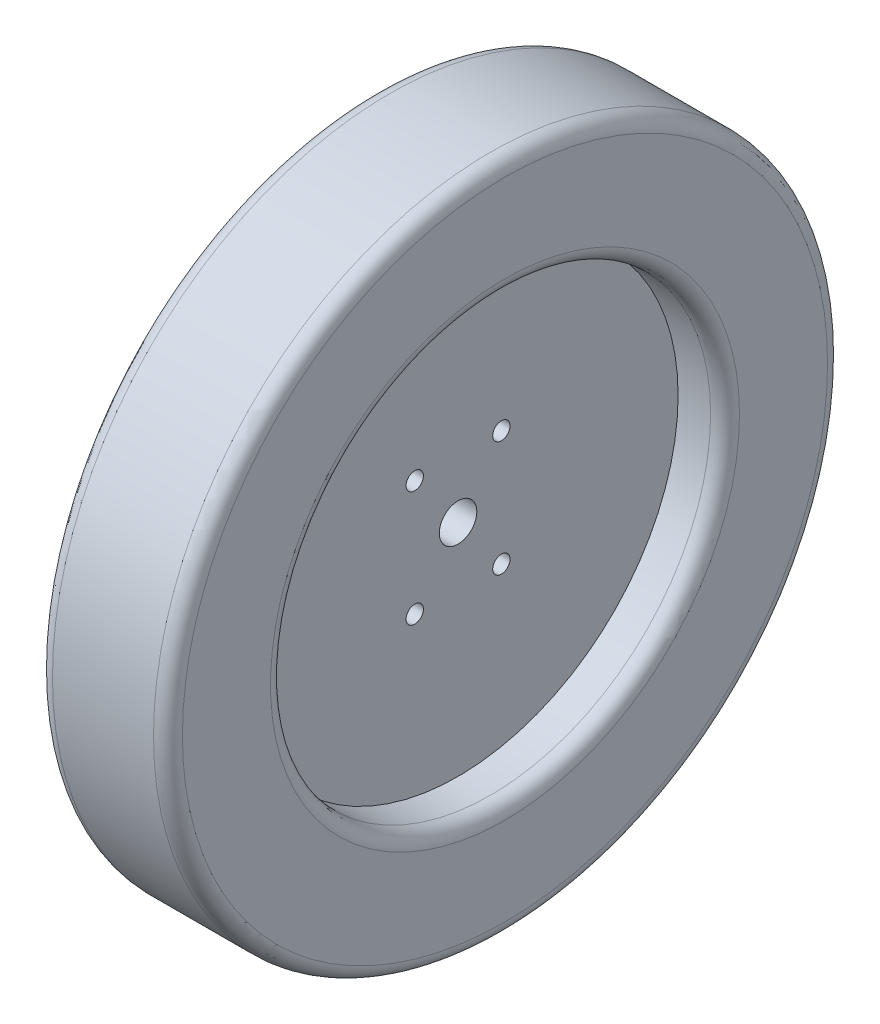
ISO-10303-21;
HEADER;
FILE_DESCRIPTION(('STEP AP214'),'2;1');
FILE_NAME('part.step','',(''),(''),'','','');
FILE_SCHEMA(('AUTOMOTIVE_DESIGN { 1 0 10303 214 1 1 1 1 }'));
ENDSEC;
DATA;
#1=APPLICATION_CONTEXT('core data for automotive mechanical design processes');
#2=APPLICATION_PROTOCOL_DEFINITION('international standard','automotive_design',2000,#1);
#3=PRODUCT_CONTEXT('',#1,'mechanical');
#4=PRODUCT('Part','Part','',(#3));
#5=PRODUCT_RELATED_PRODUCT_CATEGORY('part','',(#4));
#6=PRODUCT_DEFINITION_FORMATION('','',#4);
#7=PRODUCT_DEFINITION_CONTEXT('part definition',#1,'design');
#8=PRODUCT_DEFINITION('design','',#6,#7);
#9=PRODUCT_DEFINITION_SHAPE('','',#8);
#10=(LENGTH_UNIT() NAMED_UNIT(*) SI_UNIT(.MILLI.,.METRE.));
#11=(NAMED_UNIT(*) PLANE_ANGLE_UNIT() SI_UNIT($,.RADIAN.));
#12=(NAMED_UNIT(*) SI_UNIT($,.STERADIAN.) SOLID_ANGLE_UNIT());
#13=UNCERTAINTY_MEASURE_WITH_UNIT(LENGTH_MEASURE(1.E-05),#10,'distance_accuracy_value','');
#14=(GEOMETRIC_REPRESENTATION_CONTEXT(3) GLOBAL_UNCERTAINTY_ASSIGNED_CONTEXT((#13)) GLOBAL_UNIT_ASSIGNED_CONTEXT((#10,
#11,#12)) REPRESENTATION_CONTEXT('',''));
#15=CARTESIAN_POINT('',(0.,0.,0.));
#16=DIRECTION('',(0.,0.,1.));
#17=DIRECTION('',(1.,0.,0.));
#18=AXIS2_PLACEMENT_3D('',#15,#16,#17);
#19=CARTESIAN_POINT('',(-12.5,0.,0.));
#20=DIRECTION('',(1.,0.,0.));
#21=DIRECTION('',(0.,0.,-1.));
#22=AXIS2_PLACEMENT_3D('',#19,#20,#21);
#23=PLANE('',#22);
#24=CARTESIAN_POINT('',(-12.5,-40.,-30.));
#25=DIRECTION('',(1.,0.,0.));
#26=DIRECTION('',(0.,0.,-1.));
#27=AXIS2_PLACEMENT_3D('',#24,#25,#26);
#28=CIRCLE('',#27,5.99999999999999);
#29=CARTESIAN_POINT('',(-12.5,-40.,-36.));
#30=VERTEX_POINT('',#29);
#31=EDGE_CURVE('E91',#30,#30,#28,.F.);
#32=ORIENTED_EDGE('',*,*,#31,.F.);
#33=EDGE_LOOP('',(#32));
#34=FACE_BOUND('',#33,.T.);
#35=CARTESIAN_POINT('',(-12.5,0.,0.));
#36=DIRECTION('',(1.,0.,0.));
#37=DIRECTION('',(0.,0.,-1.));
#38=AXIS2_PLACEMENT_3D('',#35,#36,#37);
#39=CIRCLE('',#38,13.);
#40=CARTESIAN_POINT('',(-12.5,0.,-13.));
#41=VERTEX_POINT('',#40);
#42=EDGE_CURVE('E73',#41,#41,#39,.T.);
#43=ORIENTED_EDGE('',*,*,#42,.T.);
#44=EDGE_LOOP('',(#43));
#45=FACE_BOUND('',#44,.T.);
#46=CARTESIAN_POINT('',(-12.5,0.,0.));
#47=DIRECTION('',(1.,0.,0.));
#48=DIRECTION('',(0.,0.,-1.));
#49=AXIS2_PLACEMENT_3D('',#46,#47,#48);
#50=CIRCLE('',#49,152.4);
#51=CARTESIAN_POINT('',(-12.5,0.,-152.4));
#52=VERTEX_POINT('',#51);
#53=EDGE_CURVE('E95',#52,#52,#50,.T.);
#54=ORIENTED_EDGE('',*,*,#53,.F.);
#55=EDGE_LOOP('',(#54));
#56=FACE_BOUND('',#55,.T.);
#57=CARTESIAN_POINT('',(-12.5,40.,30.));
#58=DIRECTION('',(1.,0.,0.));
#59=DIRECTION('',(0.,0.,-1.));
#60=AXIS2_PLACEMENT_3D('',#57,#58,#59);
#61=CIRCLE('',#60,6.);
#62=CARTESIAN_POINT('',(-12.5,40.,24.));
#63=VERTEX_POINT('',#62);
#64=EDGE_CURVE('E64',#63,#63,#61,.F.);
#65=ORIENTED_EDGE('',*,*,#64,.F.);
#66=EDGE_LOOP('',(#65));
#67=FACE_BOUND('',#66,.T.);
#68=CARTESIAN_POINT('',(-12.5,40.,-30.));
#69=DIRECTION('',(1.,0.,0.));
#70=DIRECTION('',(0.,0.,-1.));
#71=AXIS2_PLACEMENT_3D('',#68,#69,#70);
#72=CIRCLE('',#71,6.);
#73=CARTESIAN_POINT('',(-12.5,40.,-36.));
#74=VERTEX_POINT('',#73);
#75=EDGE_CURVE('E69',#74,#74,#72,.T.);
#76=ORIENTED_EDGE('',*,*,#75,.T.);
#77=EDGE_LOOP('',(#76));
#78=FACE_BOUND('',#77,.T.);
#79=CARTESIAN_POINT('',(-12.5,-40.,30.));
#80=DIRECTION('',(1.,0.,0.));
#81=DIRECTION('',(0.,0.,-1.));
#82=AXIS2_PLACEMENT_3D('',#79,#80,#81);
#83=CIRCLE('',#82,5.99999999999999);
#84=CARTESIAN_POINT('',(-12.5,-40.,24.));
#85=VERTEX_POINT('',#84);
#86=EDGE_CURVE('E77',#85,#85,#83,.T.);
#87=ORIENTED_EDGE('',*,*,#86,.T.);
#88=EDGE_LOOP('',(#87));
#89=FACE_BOUND('',#88,.T.);
#90=ADVANCED_FACE('F41',(#34,#45,#56,#67,#78,#89),#23,.F.);
#91=CARTESIAN_POINT('',(12.5,0.,0.));
#92=DIRECTION('',(1.,0.,0.));
#93=DIRECTION('',(0.,0.,-1.));
#94=AXIS2_PLACEMENT_3D('',#91,#92,#93);
#95=PLANE('',#94);
#96=CARTESIAN_POINT('',(12.5,-40.,-30.));
#97=DIRECTION('',(1.,0.,0.));
#98=DIRECTION('',(0.,0.,-1.));
#99=AXIS2_PLACEMENT_3D('',#96,#97,#98);
#100=CIRCLE('',#99,5.99999999999999);
#101=CARTESIAN_POINT('',(12.5,-40.,-36.));
#102=VERTEX_POINT('',#101);
#103=EDGE_CURVE('E45',#102,#102,#100,.F.);
#104=ORIENTED_EDGE('',*,*,#103,.T.);
#105=EDGE_LOOP('',(#104));
#106=FACE_BOUND('',#105,.T.);
#107=CARTESIAN_POINT('',(12.5,40.,30.));
#108=DIRECTION('',(1.,0.,0.));
#109=DIRECTION('',(0.,0.,-1.));
#110=AXIS2_PLACEMENT_3D('',#107,#108,#109);
#111=CIRCLE('',#110,6.);
#112=CARTESIAN_POINT('',(12.5,40.,24.));
#113=VERTEX_POINT('',#112);
#114=EDGE_CURVE('E60',#113,#113,#111,.F.);
#115=ORIENTED_EDGE('',*,*,#114,.T.);
#116=EDGE_LOOP('',(#115));
#117=FACE_BOUND('',#116,.T.);
#118=CARTESIAN_POINT('',(12.5,0.,0.));
#119=DIRECTION('',(1.,0.,0.));
#120=DIRECTION('',(0.,0.,-1.));
#121=AXIS2_PLACEMENT_3D('',#118,#119,#120);
#122=CIRCLE('',#121,152.4);
#123=CARTESIAN_POINT('',(12.5,0.,-152.4));
#124=VERTEX_POINT('',#123);
#125=EDGE_CURVE('E99',#124,#124,#122,.T.);
#126=ORIENTED_EDGE('',*,*,#125,.T.);
#127=EDGE_LOOP('',(#126));
#128=FACE_BOUND('',#127,.T.);
#129=CARTESIAN_POINT('',(12.5,40.,-30.));
#130=DIRECTION('',(1.,0.,0.));
#131=DIRECTION('',(0.,0.,-1.));
#132=AXIS2_PLACEMENT_3D('',#129,#130,#131);
#133=CIRCLE('',#132,6.);
#134=CARTESIAN_POINT('',(12.5,40.,-36.));
#135=VERTEX_POINT('',#134);
#136=EDGE_CURVE('E65',#135,#135,#133,.T.);
#137=ORIENTED_EDGE('',*,*,#136,.F.);
#138=EDGE_LOOP('',(#137));
#139=FACE_BOUND('',#138,.T.);
#140=CARTESIAN_POINT('',(12.5,0.,0.));
#141=DIRECTION('',(1.,0.,0.));
#142=DIRECTION('',(0.,0.,-1.));
#143=AXIS2_PLACEMENT_3D('',#140,#141,#142);
#144=CIRCLE('',#143,13.);
#145=CARTESIAN_POINT('',(12.5,0.,-13.));
#146=VERTEX_POINT('',#145);
#147=EDGE_CURVE('E70',#146,#146,#144,.T.);
#148=ORIENTED_EDGE('',*,*,#147,.F.);
#149=EDGE_LOOP('',(#148));
#150=FACE_BOUND('',#149,.T.);
#151=CARTESIAN_POINT('',(12.5,-40.,30.));
#152=DIRECTION('',(1.,0.,0.));
#153=DIRECTION('',(0.,0.,-1.));
#154=AXIS2_PLACEMENT_3D('',#151,#152,#153);
#155=CIRCLE('',#154,5.99999999999999);
#156=CARTESIAN_POINT('',(12.5,-40.,24.));
#157=VERTEX_POINT('',#156);
#158=EDGE_CURVE('E74',#157,#157,#155,.T.);
#159=ORIENTED_EDGE('',*,*,#158,.F.);
#160=EDGE_LOOP('',(#159));
#161=FACE_BOUND('',#160,.T.);
#162=ADVANCED_FACE('F144',(#106,#117,#128,#139,#150,#161),#95,.T.);
#163=CARTESIAN_POINT('',(45.,0.,0.));
#164=DIRECTION('',(-1.,0.,0.));
#165=DIRECTION('',(0.,0.,1.));
#166=AXIS2_PLACEMENT_3D('',#163,#164,#165);
#167=CYLINDRICAL_SURFACE('',#166,152.4);
#168=CARTESIAN_POINT('',(-35.,0.,0.));
#169=DIRECTION('',(1.,0.,0.));
#170=DIRECTION('',(0.,0.,-1.));
#171=AXIS2_PLACEMENT_3D('',#168,#169,#170);
#172=CIRCLE('',#171,152.4);
#173=CARTESIAN_POINT('',(-35.,0.,-152.4));
#174=VERTEX_POINT('',#173);
#175=EDGE_CURVE('E11',#174,#174,#172,.F.);
#176=ORIENTED_EDGE('',*,*,#175,.T.);
#177=EDGE_LOOP('',(#176));
#178=FACE_BOUND('',#177,.T.);
#179=ORIENTED_EDGE('',*,*,#53,.T.);
#180=EDGE_LOOP('',(#179));
#181=FACE_BOUND('',#180,.T.);
#182=ADVANCED_FACE('F141',(#178,#181),#167,.F.);
#183=CARTESIAN_POINT('',(45.,0.,0.));
#184=DIRECTION('',(1.,0.,0.));
#185=DIRECTION('',(0.,0.,-1.));
#186=AXIS2_PLACEMENT_3D('',#183,#184,#185);
#187=PLANE('',#186);
#188=CARTESIAN_POINT('',(45.,0.,0.));
#189=DIRECTION('',(1.,0.,0.));
#190=DIRECTION('',(0.,0.,-1.));
#191=AXIS2_PLACEMENT_3D('',#188,#189,#190);
#192=CIRCLE('',#191,162.4);
#193=CARTESIAN_POINT('',(45.,0.,-162.4));
#194=VERTEX_POINT('',#193);
#195=EDGE_CURVE('E56',#194,#194,#192,.F.);
#196=ORIENTED_EDGE('',*,*,#195,.T.);
#197=EDGE_LOOP('',(#196));
#198=FACE_BOUND('',#197,.T.);
#199=CARTESIAN_POINT('',(45.,0.,0.));
#200=DIRECTION('',(1.,0.,0.));
#201=DIRECTION('',(0.,0.,-1.));
#202=AXIS2_PLACEMENT_3D('',#199,#200,#201);
#203=CIRCLE('',#202,223.4);
#204=CARTESIAN_POINT('',(45.,0.,-223.4));
#205=VERTEX_POINT('',#204);
#206=EDGE_CURVE('E103',#205,#205,#203,.T.);
#207=ORIENTED_EDGE('',*,*,#206,.T.);
#208=EDGE_LOOP('',(#207));
#209=FACE_BOUND('',#208,.T.);
#210=ADVANCED_FACE('F126',(#198,#209),#187,.T.);
#211=CARTESIAN_POINT('',(-45.,0.,0.));
#212=DIRECTION('',(1.,0.,0.));
#213=DIRECTION('',(0.,0.,-1.));
#214=AXIS2_PLACEMENT_3D('',#211,#212,#213);
#215=PLANE('',#214);
#216=CARTESIAN_POINT('',(-45.,0.,0.));
#217=DIRECTION('',(1.,0.,0.));
#218=DIRECTION('',(0.,0.,-1.));
#219=AXIS2_PLACEMENT_3D('',#216,#217,#218);
#220=CIRCLE('',#219,162.4);
#221=CARTESIAN_POINT('',(-45.,0.,-162.4));
#222=VERTEX_POINT('',#221);
#223=EDGE_CURVE('E50',#222,#222,#220,.T.);
#224=ORIENTED_EDGE('',*,*,#223,.T.);
#225=EDGE_LOOP('',(#224));
#226=FACE_BOUND('',#225,.T.);
#227=CARTESIAN_POINT('',(-45.,0.,0.));
#228=DIRECTION('',(1.,0.,0.));
#229=DIRECTION('',(0.,0.,-1.));
#230=AXIS2_PLACEMENT_3D('',#227,#228,#229);
#231=CIRCLE('',#230,223.4);
#232=CARTESIAN_POINT('',(-45.,0.,-223.4));
#233=VERTEX_POINT('',#232);
#234=EDGE_CURVE('E115',#233,#233,#231,.F.);
#235=ORIENTED_EDGE('',*,*,#234,.T.);
#236=EDGE_LOOP('',(#235));
#237=FACE_BOUND('',#236,.T.);
#238=ADVANCED_FACE('F179',(#226,#237),#215,.F.);
#239=CARTESIAN_POINT('',(45.,0.,0.));
#240=DIRECTION('',(-1.,0.,0.));
#241=DIRECTION('',(0.,0.,1.));
#242=AXIS2_PLACEMENT_3D('',#239,#240,#241);
#243=CYLINDRICAL_SURFACE('',#242,233.4);
#244=CARTESIAN_POINT('',(-35.,0.,0.));
#245=DIRECTION('',(1.,0.,0.));
#246=DIRECTION('',(0.,0.,-1.));
#247=AXIS2_PLACEMENT_3D('',#244,#245,#246);
#248=CIRCLE('',#247,233.4);
#249=CARTESIAN_POINT('',(-35.,0.,-233.4));
#250=VERTEX_POINT('',#249);
#251=EDGE_CURVE('E111',#250,#250,#248,.T.);
#252=ORIENTED_EDGE('',*,*,#251,.T.);
#253=EDGE_LOOP('',(#252));
#254=FACE_BOUND('',#253,.T.);
#255=CARTESIAN_POINT('',(35.,0.,0.));
#256=DIRECTION('',(1.,0.,0.));
#257=DIRECTION('',(0.,0.,-1.));
#258=AXIS2_PLACEMENT_3D('',#255,#256,#257);
#259=CIRCLE('',#258,233.4);
#260=CARTESIAN_POINT('',(35.,0.,-233.4));
#261=VERTEX_POINT('',#260);
#262=EDGE_CURVE('E107',#261,#261,#259,.F.);
#263=ORIENTED_EDGE('',*,*,#262,.T.);
#264=EDGE_LOOP('',(#263));
#265=FACE_BOUND('',#264,.T.);
#266=ADVANCED_FACE('F139',(#254,#265),#243,.T.);
#267=CARTESIAN_POINT('',(35.,0.,0.));
#268=DIRECTION('',(1.,0.,0.));
#269=DIRECTION('',(0.,0.,-1.));
#270=AXIS2_PLACEMENT_3D('',#267,#268,#269);
#271=CIRCLE('',#270,152.4);
#272=CARTESIAN_POINT('',(35.,0.,-152.4));
#273=VERTEX_POINT('',#272);
#274=EDGE_CURVE('E119',#273,#273,#271,.T.);
#275=ORIENTED_EDGE('',*,*,#274,.T.);
#276=EDGE_LOOP('',(#275));
#277=FACE_BOUND('',#276,.T.);
#278=ORIENTED_EDGE('',*,*,#125,.F.);
#279=EDGE_LOOP('',(#278));
#280=FACE_BOUND('',#279,.T.);
#281=ADVANCED_FACE('F135',(#277,#280),#167,.F.);
#282=CARTESIAN_POINT('',(35.,0.,0.));
#283=DIRECTION('',(1.,0.,0.));
#284=DIRECTION('',(0.,0.,-1.));
#285=AXIS2_PLACEMENT_3D('',#282,#283,#284);
#286=TOROIDAL_SURFACE('',#285,223.4,10.);
#287=ORIENTED_EDGE('',*,*,#262,.F.);
#288=EDGE_LOOP('',(#287));
#289=FACE_BOUND('',#288,.T.);
#290=ORIENTED_EDGE('',*,*,#206,.F.);
#291=EDGE_LOOP('',(#290));
#292=FACE_BOUND('',#291,.T.);
#293=ADVANCED_FACE('F138',(#289,#292),#286,.T.);
#294=CARTESIAN_POINT('',(-35.,0.,0.));
#295=DIRECTION('',(1.,0.,0.));
#296=DIRECTION('',(0.,0.,-1.));
#297=AXIS2_PLACEMENT_3D('',#294,#295,#296);
#298=TOROIDAL_SURFACE('',#297,223.4,10.);
#299=ORIENTED_EDGE('',*,*,#234,.F.);
#300=EDGE_LOOP('',(#299));
#301=FACE_BOUND('',#300,.T.);
#302=ORIENTED_EDGE('',*,*,#251,.F.);
#303=EDGE_LOOP('',(#302));
#304=FACE_BOUND('',#303,.T.);
#305=ADVANCED_FACE('F132',(#301,#304),#298,.T.);
#306=CARTESIAN_POINT('',(35.,0.,0.));
#307=DIRECTION('',(1.,0.,0.));
#308=DIRECTION('',(0.,0.,-1.));
#309=AXIS2_PLACEMENT_3D('',#306,#307,#308);
#310=TOROIDAL_SURFACE('',#309,162.4,10.);
#311=ORIENTED_EDGE('',*,*,#195,.F.);
#312=EDGE_LOOP('',(#311));
#313=FACE_BOUND('',#312,.T.);
#314=ORIENTED_EDGE('',*,*,#274,.F.);
#315=EDGE_LOOP('',(#314));
#316=FACE_BOUND('',#315,.T.);
#317=ADVANCED_FACE('F129',(#313,#316),#310,.T.);
#318=CARTESIAN_POINT('',(-35.,0.,0.));
#319=DIRECTION('',(1.,0.,0.));
#320=DIRECTION('',(0.,0.,-1.));
#321=AXIS2_PLACEMENT_3D('',#318,#319,#320);
#322=TOROIDAL_SURFACE('',#321,162.4,10.);
#323=ORIENTED_EDGE('',*,*,#175,.F.);
#324=EDGE_LOOP('',(#323));
#325=FACE_BOUND('',#324,.T.);
#326=ORIENTED_EDGE('',*,*,#223,.F.);
#327=EDGE_LOOP('',(#326));
#328=FACE_BOUND('',#327,.T.);
#329=ADVANCED_FACE('F43',(#325,#328),#322,.T.);
#330=CARTESIAN_POINT('',(-45.,40.,30.));
#331=DIRECTION('',(1.,0.,0.));
#332=DIRECTION('',(0.,0.,-1.));
#333=AXIS2_PLACEMENT_3D('',#330,#331,#332);
#334=CYLINDRICAL_SURFACE('',#333,6.);
#335=ORIENTED_EDGE('',*,*,#114,.F.);
#336=EDGE_LOOP('',(#335));
#337=FACE_BOUND('',#336,.T.);
#338=ORIENTED_EDGE('',*,*,#64,.T.);
#339=EDGE_LOOP('',(#338));
#340=FACE_BOUND('',#339,.T.);
#341=ADVANCED_FACE('F166',(#337,#340),#334,.F.);
#342=CARTESIAN_POINT('',(-45.,40.,-30.));
#343=DIRECTION('',(1.,0.,0.));
#344=DIRECTION('',(0.,0.,-1.));
#345=AXIS2_PLACEMENT_3D('',#342,#343,#344);
#346=CYLINDRICAL_SURFACE('',#345,6.);
#347=ORIENTED_EDGE('',*,*,#136,.T.);
#348=EDGE_LOOP('',(#347));
#349=FACE_BOUND('',#348,.T.);
#350=ORIENTED_EDGE('',*,*,#75,.F.);
#351=EDGE_LOOP('',(#350));
#352=FACE_BOUND('',#351,.T.);
#353=ADVANCED_FACE('F158',(#349,#352),#346,.F.);
#354=CARTESIAN_POINT('',(-45.,0.,0.));
#355=DIRECTION('',(1.,0.,0.));
#356=DIRECTION('',(0.,0.,-1.));
#357=AXIS2_PLACEMENT_3D('',#354,#355,#356);
#358=CYLINDRICAL_SURFACE('',#357,13.);
#359=ORIENTED_EDGE('',*,*,#147,.T.);
#360=EDGE_LOOP('',(#359));
#361=FACE_BOUND('',#360,.T.);
#362=ORIENTED_EDGE('',*,*,#42,.F.);
#363=EDGE_LOOP('',(#362));
#364=FACE_BOUND('',#363,.T.);
#365=ADVANCED_FACE('F154',(#361,#364),#358,.F.);
#366=CARTESIAN_POINT('',(-45.,-40.,30.));
#367=DIRECTION('',(1.,0.,0.));
#368=DIRECTION('',(0.,0.,-1.));
#369=AXIS2_PLACEMENT_3D('',#366,#367,#368);
#370=CYLINDRICAL_SURFACE('',#369,5.99999999999999);
#371=ORIENTED_EDGE('',*,*,#158,.T.);
#372=EDGE_LOOP('',(#371));
#373=FACE_BOUND('',#372,.T.);
#374=ORIENTED_EDGE('',*,*,#86,.F.);
#375=EDGE_LOOP('',(#374));
#376=FACE_BOUND('',#375,.T.);
#377=ADVANCED_FACE('F157',(#373,#376),#370,.F.);
#378=CARTESIAN_POINT('',(-45.,-40.,-30.));
#379=DIRECTION('',(1.,0.,0.));
#380=DIRECTION('',(0.,0.,-1.));
#381=AXIS2_PLACEMENT_3D('',#378,#379,#380);
#382=CYLINDRICAL_SURFACE('',#381,5.99999999999999);
#383=ORIENTED_EDGE('',*,*,#103,.F.);
#384=EDGE_LOOP('',(#383));
#385=FACE_BOUND('',#384,.T.);
#386=ORIENTED_EDGE('',*,*,#31,.T.);
#387=EDGE_LOOP('',(#386));
#388=FACE_BOUND('',#387,.T.);
#389=ADVANCED_FACE('F164',(#385,#388),#382,.F.);
#390=CLOSED_SHELL('',(#90,#162,#182,#210,#238,#266,#281,#293,#305,#317,#329,#341,#353,#365,#377,#389));
#391=MANIFOLD_SOLID_BREP('B2',#390);
#392=ADVANCED_BREP_SHAPE_REPRESENTATION('',(#18,#391),#14);
#393=SHAPE_DEFINITION_REPRESENTATION(#9,#392);
ENDSEC;
END-ISO-10303-21;
